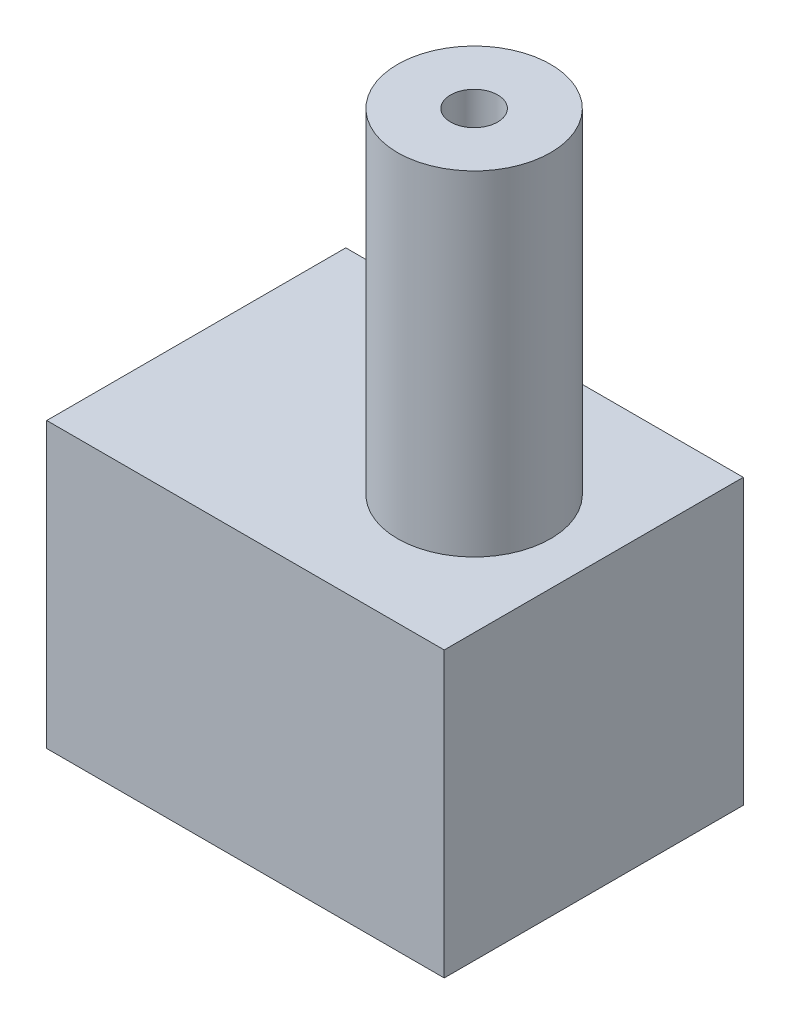
ISO-10303-21;
HEADER;
FILE_DESCRIPTION(('STEP AP214'),'2;1');
FILE_NAME('part.step','',(''),(''),'','','');
FILE_SCHEMA(('AUTOMOTIVE_DESIGN { 1 0 10303 214 1 1 1 1 }'));
ENDSEC;
DATA;
#1=APPLICATION_CONTEXT('core data for automotive mechanical design processes');
#2=APPLICATION_PROTOCOL_DEFINITION('international standard','automotive_design',2000,#1);
#3=PRODUCT_CONTEXT('',#1,'mechanical');
#4=PRODUCT('Part','Part','',(#3));
#5=PRODUCT_RELATED_PRODUCT_CATEGORY('part','',(#4));
#6=PRODUCT_DEFINITION_FORMATION('','',#4);
#7=PRODUCT_DEFINITION_CONTEXT('part definition',#1,'design');
#8=PRODUCT_DEFINITION('design','',#6,#7);
#9=PRODUCT_DEFINITION_SHAPE('','',#8);
#10=(LENGTH_UNIT() NAMED_UNIT(*) SI_UNIT(.MILLI.,.METRE.));
#11=(NAMED_UNIT(*) PLANE_ANGLE_UNIT() SI_UNIT($,.RADIAN.));
#12=(NAMED_UNIT(*) SI_UNIT($,.STERADIAN.) SOLID_ANGLE_UNIT());
#13=UNCERTAINTY_MEASURE_WITH_UNIT(LENGTH_MEASURE(1.E-05),#10,'distance_accuracy_value','');
#14=(GEOMETRIC_REPRESENTATION_CONTEXT(3) GLOBAL_UNCERTAINTY_ASSIGNED_CONTEXT((#13)) GLOBAL_UNIT_ASSIGNED_CONTEXT((#10,
#11,#12)) REPRESENTATION_CONTEXT('',''));
#15=CARTESIAN_POINT('',(0.,0.,0.));
#16=DIRECTION('',(0.,0.,1.));
#17=DIRECTION('',(1.,0.,0.));
#18=AXIS2_PLACEMENT_3D('',#15,#16,#17);
#19=CARTESIAN_POINT('',(0.,12.065,0.));
#20=DIRECTION('',(0.,1.,0.));
#21=DIRECTION('',(0.,0.,1.));
#22=AXIS2_PLACEMENT_3D('',#19,#20,#21);
#23=PLANE('',#22);
#24=DIRECTION('',(1.,0.,0.));
#25=VECTOR('',#24,1.);
#26=CARTESIAN_POINT('',(0.,12.065,0.));
#27=LINE('',#26,#25);
#28=CARTESIAN_POINT('',(0.,12.065,0.));
#29=VERTEX_POINT('',#28);
#30=CARTESIAN_POINT('',(16.88,12.065,0.));
#31=VERTEX_POINT('',#30);
#32=EDGE_CURVE('E85',#29,#31,#27,.T.);
#33=ORIENTED_EDGE('',*,*,#32,.T.);
#34=DIRECTION('',(0.,0.,-1.));
#35=VECTOR('',#34,1.);
#36=CARTESIAN_POINT('',(16.88,12.065,0.));
#37=LINE('',#36,#35);
#38=CARTESIAN_POINT('',(16.88,12.065,-12.7));
#39=VERTEX_POINT('',#38);
#40=EDGE_CURVE('E80',#31,#39,#37,.T.);
#41=ORIENTED_EDGE('',*,*,#40,.T.);
#42=DIRECTION('',(-1.,0.,0.));
#43=VECTOR('',#42,1.);
#44=CARTESIAN_POINT('',(0.,12.065,-12.7));
#45=LINE('',#44,#43);
#46=CARTESIAN_POINT('',(0.,12.065,-12.7));
#47=VERTEX_POINT('',#46);
#48=EDGE_CURVE('E83',#39,#47,#45,.T.);
#49=ORIENTED_EDGE('',*,*,#48,.T.);
#50=DIRECTION('',(0.,0.,1.));
#51=VECTOR('',#50,1.);
#52=CARTESIAN_POINT('',(0.,12.065,0.));
#53=LINE('',#52,#51);
#54=EDGE_CURVE('E50',#47,#29,#53,.T.);
#55=ORIENTED_EDGE('',*,*,#54,.T.);
#56=EDGE_LOOP('',(#33,#41,#49,#55));
#57=FACE_BOUND('',#56,.T.);
#58=CARTESIAN_POINT('',(11.8,12.065,-6.35));
#59=DIRECTION('',(0.,1.,0.));
#60=DIRECTION('',(0.,0.,1.));
#61=AXIS2_PLACEMENT_3D('',#58,#59,#60);
#62=CIRCLE('',#61,3.25);
#63=CARTESIAN_POINT('',(11.8,12.065,-3.1));
#64=VERTEX_POINT('',#63);
#65=EDGE_CURVE('E111',#64,#64,#62,.T.);
#66=ORIENTED_EDGE('',*,*,#65,.F.);
#67=EDGE_LOOP('',(#66));
#68=FACE_BOUND('',#67,.T.);
#69=ADVANCED_FACE('F33',(#57,#68),#23,.T.);
#70=CARTESIAN_POINT('',(0.,12.065,0.));
#71=DIRECTION('',(0.,0.,-1.));
#72=DIRECTION('',(-1.,0.,0.));
#73=AXIS2_PLACEMENT_3D('',#70,#71,#72);
#74=PLANE('',#73);
#75=DIRECTION('',(1.,0.,0.));
#76=VECTOR('',#75,1.);
#77=CARTESIAN_POINT('',(0.,0.,0.));
#78=LINE('',#77,#76);
#79=CARTESIAN_POINT('',(0.,0.,0.));
#80=VERTEX_POINT('',#79);
#81=CARTESIAN_POINT('',(16.88,0.,0.));
#82=VERTEX_POINT('',#81);
#83=EDGE_CURVE('E97',#80,#82,#78,.T.);
#84=ORIENTED_EDGE('',*,*,#83,.T.);
#85=DIRECTION('',(0.,-1.,0.));
#86=VECTOR('',#85,1.);
#87=CARTESIAN_POINT('',(16.88,12.065,0.));
#88=LINE('',#87,#86);
#89=EDGE_CURVE('E11',#31,#82,#88,.T.);
#90=ORIENTED_EDGE('',*,*,#89,.F.);
#91=ORIENTED_EDGE('',*,*,#32,.F.);
#92=DIRECTION('',(0.,-1.,0.));
#93=VECTOR('',#92,1.);
#94=CARTESIAN_POINT('',(0.,12.065,0.));
#95=LINE('',#94,#93);
#96=EDGE_CURVE('E93',#29,#80,#95,.T.);
#97=ORIENTED_EDGE('',*,*,#96,.T.);
#98=EDGE_LOOP('',(#84,#90,#91,#97));
#99=FACE_BOUND('',#98,.T.);
#100=ADVANCED_FACE('F35',(#99),#74,.F.);
#101=CARTESIAN_POINT('',(16.88,12.065,0.));
#102=DIRECTION('',(-1.,0.,0.));
#103=DIRECTION('',(0.,0.,1.));
#104=AXIS2_PLACEMENT_3D('',#101,#102,#103);
#105=PLANE('',#104);
#106=DIRECTION('',(0.,0.,-1.));
#107=VECTOR('',#106,1.);
#108=CARTESIAN_POINT('',(16.88,0.,0.));
#109=LINE('',#108,#107);
#110=CARTESIAN_POINT('',(16.88,0.,-12.7));
#111=VERTEX_POINT('',#110);
#112=EDGE_CURVE('E89',#82,#111,#109,.T.);
#113=ORIENTED_EDGE('',*,*,#112,.T.);
#114=DIRECTION('',(0.,-1.,0.));
#115=VECTOR('',#114,1.);
#116=CARTESIAN_POINT('',(16.88,12.065,-12.7));
#117=LINE('',#116,#115);
#118=EDGE_CURVE('E42',#39,#111,#117,.T.);
#119=ORIENTED_EDGE('',*,*,#118,.F.);
#120=ORIENTED_EDGE('',*,*,#40,.F.);
#121=ORIENTED_EDGE('',*,*,#89,.T.);
#122=EDGE_LOOP('',(#113,#119,#120,#121));
#123=FACE_BOUND('',#122,.T.);
#124=ADVANCED_FACE('F88',(#123),#105,.F.);
#125=CARTESIAN_POINT('',(0.,12.065,-12.7));
#126=DIRECTION('',(0.,0.,1.));
#127=DIRECTION('',(1.,0.,0.));
#128=AXIS2_PLACEMENT_3D('',#125,#126,#127);
#129=PLANE('',#128);
#130=DIRECTION('',(-1.,0.,0.));
#131=VECTOR('',#130,1.);
#132=CARTESIAN_POINT('',(0.,0.,-12.7));
#133=LINE('',#132,#131);
#134=CARTESIAN_POINT('',(0.,0.,-12.7));
#135=VERTEX_POINT('',#134);
#136=EDGE_CURVE('E67',#111,#135,#133,.T.);
#137=ORIENTED_EDGE('',*,*,#136,.T.);
#138=DIRECTION('',(0.,-1.,0.));
#139=VECTOR('',#138,1.);
#140=CARTESIAN_POINT('',(0.,12.065,-12.7));
#141=LINE('',#140,#139);
#142=EDGE_CURVE('E90',#47,#135,#141,.T.);
#143=ORIENTED_EDGE('',*,*,#142,.F.);
#144=ORIENTED_EDGE('',*,*,#48,.F.);
#145=ORIENTED_EDGE('',*,*,#118,.T.);
#146=EDGE_LOOP('',(#137,#143,#144,#145));
#147=FACE_BOUND('',#146,.T.);
#148=ADVANCED_FACE('F91',(#147),#129,.F.);
#149=CARTESIAN_POINT('',(0.,12.065,0.));
#150=DIRECTION('',(1.,0.,0.));
#151=DIRECTION('',(0.,0.,-1.));
#152=AXIS2_PLACEMENT_3D('',#149,#150,#151);
#153=PLANE('',#152);
#154=DIRECTION('',(0.,0.,1.));
#155=VECTOR('',#154,1.);
#156=CARTESIAN_POINT('',(0.,0.,0.));
#157=LINE('',#156,#155);
#158=EDGE_CURVE('E73',#135,#80,#157,.T.);
#159=ORIENTED_EDGE('',*,*,#158,.T.);
#160=ORIENTED_EDGE('',*,*,#96,.F.);
#161=ORIENTED_EDGE('',*,*,#54,.F.);
#162=ORIENTED_EDGE('',*,*,#142,.T.);
#163=EDGE_LOOP('',(#159,#160,#161,#162));
#164=FACE_BOUND('',#163,.T.);
#165=ADVANCED_FACE('F105',(#164),#153,.F.);
#166=CARTESIAN_POINT('',(0.,0.,0.));
#167=DIRECTION('',(0.,1.,0.));
#168=DIRECTION('',(0.,0.,1.));
#169=AXIS2_PLACEMENT_3D('',#166,#167,#168);
#170=PLANE('',#169);
#171=CARTESIAN_POINT('',(11.8,0.,-6.35));
#172=DIRECTION('',(0.,1.,0.));
#173=DIRECTION('',(0.,0.,1.));
#174=AXIS2_PLACEMENT_3D('',#171,#172,#173);
#175=CIRCLE('',#174,1.);
#176=CARTESIAN_POINT('',(11.8,0.,-5.35));
#177=VERTEX_POINT('',#176);
#178=EDGE_CURVE('E114',#177,#177,#175,.T.);
#179=ORIENTED_EDGE('',*,*,#178,.T.);
#180=EDGE_LOOP('',(#179));
#181=FACE_BOUND('',#180,.T.);
#182=ORIENTED_EDGE('',*,*,#83,.F.);
#183=ORIENTED_EDGE('',*,*,#158,.F.);
#184=ORIENTED_EDGE('',*,*,#136,.F.);
#185=ORIENTED_EDGE('',*,*,#112,.F.);
#186=EDGE_LOOP('',(#182,#183,#184,#185));
#187=FACE_BOUND('',#186,.T.);
#188=ADVANCED_FACE('F108',(#181,#187),#170,.F.);
#189=CARTESIAN_POINT('',(11.8,26.265,-6.35));
#190=DIRECTION('',(0.,-1.,0.));
#191=DIRECTION('',(0.,0.,-1.));
#192=AXIS2_PLACEMENT_3D('',#189,#190,#191);
#193=CYLINDRICAL_SURFACE('',#192,3.25);
#194=CARTESIAN_POINT('',(11.8,26.265,-6.35));
#195=DIRECTION('',(0.,1.,0.));
#196=DIRECTION('',(0.,0.,1.));
#197=AXIS2_PLACEMENT_3D('',#194,#195,#196);
#198=CIRCLE('',#197,3.25);
#199=CARTESIAN_POINT('',(11.8,26.265,-3.1));
#200=VERTEX_POINT('',#199);
#201=EDGE_CURVE('E100',#200,#200,#198,.T.);
#202=ORIENTED_EDGE('',*,*,#201,.F.);
#203=EDGE_LOOP('',(#202));
#204=FACE_BOUND('',#203,.T.);
#205=ORIENTED_EDGE('',*,*,#65,.T.);
#206=EDGE_LOOP('',(#205));
#207=FACE_BOUND('',#206,.T.);
#208=ADVANCED_FACE('F133',(#204,#207),#193,.T.);
#209=CARTESIAN_POINT('',(11.8,26.265,-6.35));
#210=DIRECTION('',(0.,1.,0.));
#211=DIRECTION('',(0.,0.,1.));
#212=AXIS2_PLACEMENT_3D('',#209,#210,#211);
#213=PLANE('',#212);
#214=CARTESIAN_POINT('',(11.8,26.265,-6.35));
#215=DIRECTION('',(0.,1.,0.));
#216=DIRECTION('',(0.,0.,1.));
#217=AXIS2_PLACEMENT_3D('',#214,#215,#216);
#218=CIRCLE('',#217,1.);
#219=CARTESIAN_POINT('',(11.8,26.265,-5.35));
#220=VERTEX_POINT('',#219);
#221=EDGE_CURVE('E117',#220,#220,#218,.T.);
#222=ORIENTED_EDGE('',*,*,#221,.F.);
#223=EDGE_LOOP('',(#222));
#224=FACE_BOUND('',#223,.T.);
#225=ORIENTED_EDGE('',*,*,#201,.T.);
#226=EDGE_LOOP('',(#225));
#227=FACE_BOUND('',#226,.T.);
#228=ADVANCED_FACE('F127',(#224,#227),#213,.T.);
#229=CARTESIAN_POINT('',(11.8,0.,-6.35));
#230=DIRECTION('',(0.,1.,0.));
#231=DIRECTION('',(0.,0.,1.));
#232=AXIS2_PLACEMENT_3D('',#229,#230,#231);
#233=CYLINDRICAL_SURFACE('',#232,1.);
#234=ORIENTED_EDGE('',*,*,#178,.F.);
#235=EDGE_LOOP('',(#234));
#236=FACE_BOUND('',#235,.T.);
#237=ORIENTED_EDGE('',*,*,#221,.T.);
#238=EDGE_LOOP('',(#237));
#239=FACE_BOUND('',#238,.T.);
#240=ADVANCED_FACE('F124',(#236,#239),#233,.F.);
#241=CLOSED_SHELL('',(#69,#100,#124,#148,#165,#188,#208,#228,#240));
#242=MANIFOLD_SOLID_BREP('B2',#241);
#243=ADVANCED_BREP_SHAPE_REPRESENTATION('',(#18,#242),#14);
#244=SHAPE_DEFINITION_REPRESENTATION(#9,#243);
ENDSEC;
END-ISO-10303-21;
